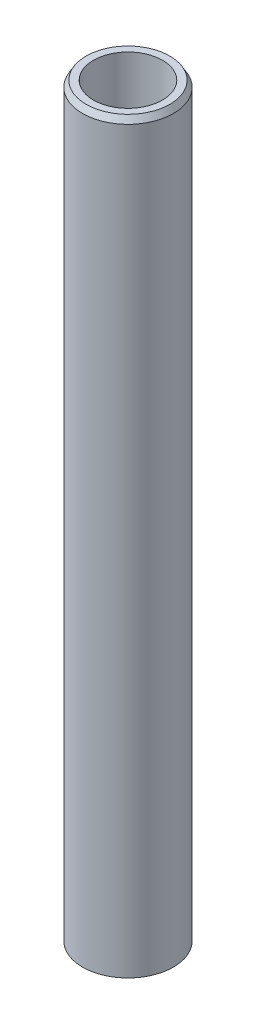
ISO-10303-21;
HEADER;
FILE_DESCRIPTION(('STEP AP214'),'2;1');
FILE_NAME('part.step','',(''),(''),'','','');
FILE_SCHEMA(('AUTOMOTIVE_DESIGN { 1 0 10303 214 1 1 1 1 }'));
ENDSEC;
DATA;
#1=APPLICATION_CONTEXT('core data for automotive mechanical design processes');
#2=APPLICATION_PROTOCOL_DEFINITION('international standard','automotive_design',2000,#1);
#3=PRODUCT_CONTEXT('',#1,'mechanical');
#4=PRODUCT('Part','Part','',(#3));
#5=PRODUCT_RELATED_PRODUCT_CATEGORY('part','',(#4));
#6=PRODUCT_DEFINITION_FORMATION('','',#4);
#7=PRODUCT_DEFINITION_CONTEXT('part definition',#1,'design');
#8=PRODUCT_DEFINITION('design','',#6,#7);
#9=PRODUCT_DEFINITION_SHAPE('','',#8);
#10=(LENGTH_UNIT() NAMED_UNIT(*) SI_UNIT(.MILLI.,.METRE.));
#11=(NAMED_UNIT(*) PLANE_ANGLE_UNIT() SI_UNIT($,.RADIAN.));
#12=(NAMED_UNIT(*) SI_UNIT($,.STERADIAN.) SOLID_ANGLE_UNIT());
#13=UNCERTAINTY_MEASURE_WITH_UNIT(LENGTH_MEASURE(1.E-05),#10,'distance_accuracy_value','');
#14=(GEOMETRIC_REPRESENTATION_CONTEXT(3) GLOBAL_UNCERTAINTY_ASSIGNED_CONTEXT((#13)) GLOBAL_UNIT_ASSIGNED_CONTEXT((#10,
#11,#12)) REPRESENTATION_CONTEXT('',''));
#15=CARTESIAN_POINT('',(0.,0.,0.));
#16=DIRECTION('',(0.,0.,1.));
#17=DIRECTION('',(1.,0.,0.));
#18=AXIS2_PLACEMENT_3D('',#15,#16,#17);
#19=CARTESIAN_POINT('',(0.,577.324740699488,0.));
#20=DIRECTION('',(0.,-1.,0.));
#21=DIRECTION('',(0.,0.,-1.));
#22=AXIS2_PLACEMENT_3D('',#19,#20,#21);
#23=CYLINDRICAL_SURFACE('',#22,35.);
#24=CARTESIAN_POINT('',(0.,572.569526809959,0.));
#25=DIRECTION('',(0.,1.,0.));
#26=DIRECTION('',(0.,0.,1.));
#27=AXIS2_PLACEMENT_3D('',#24,#25,#26);
#28=CIRCLE('',#27,35.);
#29=CARTESIAN_POINT('',(0.,572.569526809959,35.));
#30=VERTEX_POINT('',#29);
#31=EDGE_CURVE('E50',#30,#30,#28,.F.);
#32=ORIENTED_EDGE('',*,*,#31,.T.);
#33=EDGE_LOOP('',(#32));
#34=FACE_BOUND('',#33,.T.);
#35=CARTESIAN_POINT('',(0.,2.74542401917355,0.));
#36=DIRECTION('',(0.,1.,0.));
#37=DIRECTION('',(0.,0.,1.));
#38=AXIS2_PLACEMENT_3D('',#35,#36,#37);
#39=CIRCLE('',#38,35.);
#40=CARTESIAN_POINT('',(0.,2.74542401917355,35.));
#41=VERTEX_POINT('',#40);
#42=EDGE_CURVE('E51',#41,#41,#39,.T.);
#43=ORIENTED_EDGE('',*,*,#42,.T.);
#44=EDGE_LOOP('',(#43));
#45=FACE_BOUND('',#44,.T.);
#46=ADVANCED_FACE('F39',(#34,#45),#23,.T.);
#47=CARTESIAN_POINT('',(0.,577.324740699488,0.));
#48=DIRECTION('',(0.,1.,0.));
#49=DIRECTION('',(0.,0.,1.));
#50=AXIS2_PLACEMENT_3D('',#47,#48,#49);
#51=PLANE('',#50);
#52=CARTESIAN_POINT('',(0.,577.324740699488,0.));
#53=DIRECTION('',(0.,1.,0.));
#54=DIRECTION('',(0.,0.,1.));
#55=AXIS2_PLACEMENT_3D('',#52,#53,#54);
#56=CIRCLE('',#55,32.2545759808264);
#57=CARTESIAN_POINT('',(0.,577.324740699488,32.2545759808264));
#58=VERTEX_POINT('',#57);
#59=EDGE_CURVE('E54',#58,#58,#56,.T.);
#60=ORIENTED_EDGE('',*,*,#59,.T.);
#61=EDGE_LOOP('',(#60));
#62=FACE_BOUND('',#61,.T.);
#63=CARTESIAN_POINT('',(0.,577.324740699488,0.));
#64=DIRECTION('',(0.,1.,0.));
#65=DIRECTION('',(0.,0.,1.));
#66=AXIS2_PLACEMENT_3D('',#63,#64,#65);
#67=CIRCLE('',#66,26.61217324294);
#68=CARTESIAN_POINT('',(0.,577.324740699488,26.61217324294));
#69=VERTEX_POINT('',#68);
#70=EDGE_CURVE('E58',#69,#69,#67,.T.);
#71=ORIENTED_EDGE('',*,*,#70,.F.);
#72=EDGE_LOOP('',(#71));
#73=FACE_BOUND('',#72,.T.);
#74=ADVANCED_FACE('F69',(#62,#73),#51,.T.);
#75=CARTESIAN_POINT('',(0.,0.,0.));
#76=DIRECTION('',(0.,1.,0.));
#77=DIRECTION('',(0.,0.,1.));
#78=AXIS2_PLACEMENT_3D('',#75,#76,#77);
#79=PLANE('',#78);
#80=CARTESIAN_POINT('',(0.,0.,0.));
#81=DIRECTION('',(0.,1.,0.));
#82=DIRECTION('',(0.,0.,1.));
#83=AXIS2_PLACEMENT_3D('',#80,#81,#82);
#84=CIRCLE('',#83,30.2447861104714);
#85=CARTESIAN_POINT('',(0.,0.,30.2447861104714));
#86=VERTEX_POINT('',#85);
#87=EDGE_CURVE('E10',#86,#86,#84,.F.);
#88=ORIENTED_EDGE('',*,*,#87,.T.);
#89=EDGE_LOOP('',(#88));
#90=FACE_BOUND('',#89,.T.);
#91=CARTESIAN_POINT('',(0.,0.,0.));
#92=DIRECTION('',(0.,1.,0.));
#93=DIRECTION('',(0.,0.,1.));
#94=AXIS2_PLACEMENT_3D('',#91,#92,#93);
#95=CIRCLE('',#94,26.61217324294);
#96=CARTESIAN_POINT('',(0.,0.,26.61217324294));
#97=VERTEX_POINT('',#96);
#98=EDGE_CURVE('E63',#97,#97,#95,.T.);
#99=ORIENTED_EDGE('',*,*,#98,.T.);
#100=EDGE_LOOP('',(#99));
#101=FACE_BOUND('',#100,.T.);
#102=ADVANCED_FACE('F75',(#90,#101),#79,.F.);
#103=CARTESIAN_POINT('',(0.,577.324740699488,0.));
#104=DIRECTION('',(0.,-1.,0.));
#105=DIRECTION('',(0.,0.,-1.));
#106=AXIS2_PLACEMENT_3D('',#103,#104,#105);
#107=CYLINDRICAL_SURFACE('',#106,26.61217324294);
#108=ORIENTED_EDGE('',*,*,#70,.T.);
#109=EDGE_LOOP('',(#108));
#110=FACE_BOUND('',#109,.T.);
#111=ORIENTED_EDGE('',*,*,#98,.F.);
#112=EDGE_LOOP('',(#111));
#113=FACE_BOUND('',#112,.T.);
#114=ADVANCED_FACE('F70',(#110,#113),#107,.F.);
#115=CARTESIAN_POINT('',(0.,577.324740699488,0.));
#116=DIRECTION('',(0.,-1.,0.));
#117=DIRECTION('',(0.,0.,-1.));
#118=AXIS2_PLACEMENT_3D('',#115,#116,#117);
#119=CONICAL_SURFACE('',#118,32.2545759808264,0.523598775598297);
#120=ORIENTED_EDGE('',*,*,#31,.F.);
#121=EDGE_LOOP('',(#120));
#122=FACE_BOUND('',#121,.T.);
#123=ORIENTED_EDGE('',*,*,#59,.F.);
#124=EDGE_LOOP('',(#123));
#125=FACE_BOUND('',#124,.T.);
#126=ADVANCED_FACE('F81',(#122,#125),#119,.T.);
#127=CARTESIAN_POINT('',(0.,2.74542401917355,0.));
#128=DIRECTION('',(0.,1.,0.));
#129=DIRECTION('',(0.,0.,1.));
#130=AXIS2_PLACEMENT_3D('',#127,#128,#129);
#131=CONICAL_SURFACE('',#130,35.,1.0471975511966);
#132=ORIENTED_EDGE('',*,*,#87,.F.);
#133=EDGE_LOOP('',(#132));
#134=FACE_BOUND('',#133,.T.);
#135=ORIENTED_EDGE('',*,*,#42,.F.);
#136=EDGE_LOOP('',(#135));
#137=FACE_BOUND('',#136,.T.);
#138=ADVANCED_FACE('F45',(#134,#137),#131,.T.);
#139=CLOSED_SHELL('',(#46,#74,#102,#114,#126,#138));
#140=MANIFOLD_SOLID_BREP('B2',#139);
#141=ADVANCED_BREP_SHAPE_REPRESENTATION('',(#18,#140),#14);
#142=SHAPE_DEFINITION_REPRESENTATION(#9,#141);
ENDSEC;
END-ISO-10303-21;
